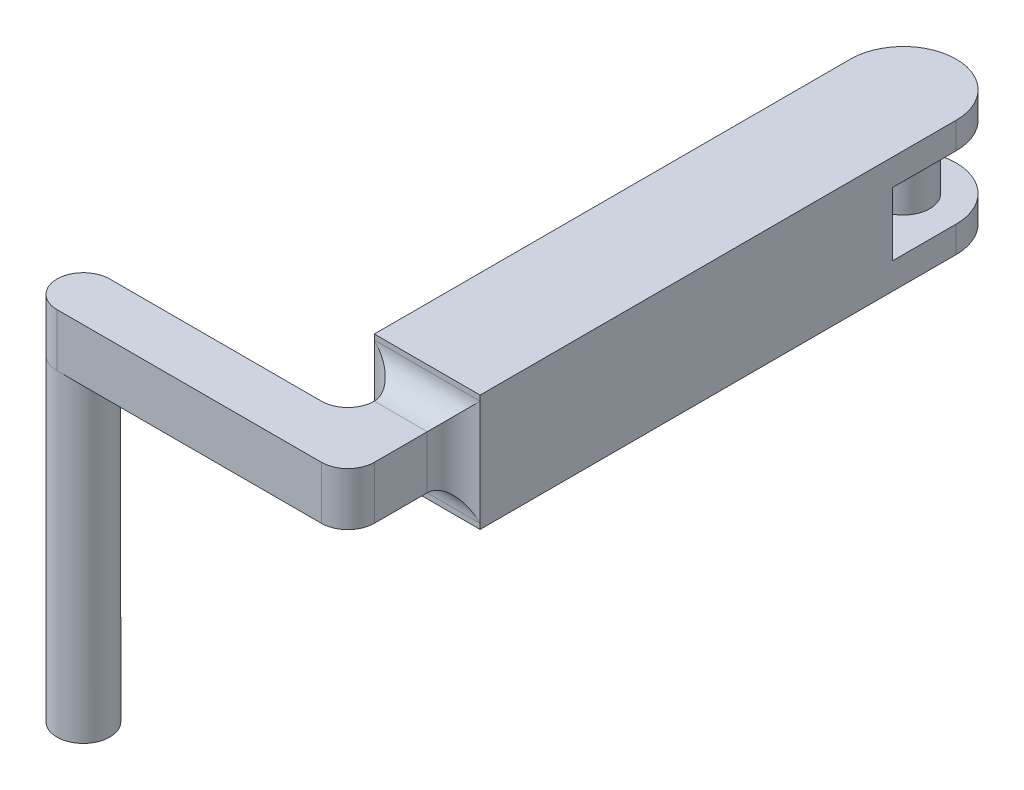
ISO-10303-21;
HEADER;
FILE_DESCRIPTION(('STEP AP214'),'2;1');
FILE_NAME('part.step','',(''),(''),'','','');
FILE_SCHEMA(('AUTOMOTIVE_DESIGN { 1 0 10303 214 1 1 1 1 }'));
ENDSEC;
DATA;
#1=APPLICATION_CONTEXT('core data for automotive mechanical design processes');
#2=APPLICATION_PROTOCOL_DEFINITION('international standard','automotive_design',2000,#1);
#3=PRODUCT_CONTEXT('',#1,'mechanical');
#4=PRODUCT('Part','Part','',(#3));
#5=PRODUCT_RELATED_PRODUCT_CATEGORY('part','',(#4));
#6=PRODUCT_DEFINITION_FORMATION('','',#4);
#7=PRODUCT_DEFINITION_CONTEXT('part definition',#1,'design');
#8=PRODUCT_DEFINITION('design','',#6,#7);
#9=PRODUCT_DEFINITION_SHAPE('','',#8);
#10=(LENGTH_UNIT() NAMED_UNIT(*) SI_UNIT(.MILLI.,.METRE.));
#11=(NAMED_UNIT(*) PLANE_ANGLE_UNIT() SI_UNIT($,.RADIAN.));
#12=(NAMED_UNIT(*) SI_UNIT($,.STERADIAN.) SOLID_ANGLE_UNIT());
#13=UNCERTAINTY_MEASURE_WITH_UNIT(LENGTH_MEASURE(1.E-05),#10,'distance_accuracy_value','');
#14=(GEOMETRIC_REPRESENTATION_CONTEXT(3) GLOBAL_UNCERTAINTY_ASSIGNED_CONTEXT((#13)) GLOBAL_UNIT_ASSIGNED_CONTEXT((#10,
#11,#12)) REPRESENTATION_CONTEXT('',''));
#15=CARTESIAN_POINT('',(0.,0.,0.));
#16=DIRECTION('',(0.,0.,1.));
#17=DIRECTION('',(1.,0.,0.));
#18=AXIS2_PLACEMENT_3D('',#15,#16,#17);
#19=CARTESIAN_POINT('',(-3.176,-0.635,-59.055));
#20=DIRECTION('',(0.,-1.,0.));
#21=DIRECTION('',(0.,0.,-1.));
#22=AXIS2_PLACEMENT_3D('',#19,#20,#21);
#23=PLANE('',#22);
#24=DIRECTION('',(0.,0.,1.));
#25=VECTOR('',#24,1.);
#26=CARTESIAN_POINT('',(25.4,-0.635,-59.055));
#27=LINE('',#26,#25);
#28=CARTESIAN_POINT('',(25.4,-0.635,-66.675));
#29=VERTEX_POINT('',#28);
#30=CARTESIAN_POINT('',(25.4,-0.635,-59.055));
#31=VERTEX_POINT('',#30);
#32=EDGE_CURVE('E347',#29,#31,#27,.T.);
#33=ORIENTED_EDGE('',*,*,#32,.T.);
#34=DIRECTION('',(1.,0.,0.));
#35=VECTOR('',#34,1.);
#36=CARTESIAN_POINT('',(-3.176,-0.635,-59.055));
#37=LINE('',#36,#35);
#38=CARTESIAN_POINT('',(38.1,-0.635,-59.055));
#39=VERTEX_POINT('',#38);
#40=EDGE_CURVE('E177',#31,#39,#37,.T.);
#41=ORIENTED_EDGE('',*,*,#40,.T.);
#42=DIRECTION('',(0.,0.,-1.));
#43=VECTOR('',#42,1.);
#44=CARTESIAN_POINT('',(38.1,-0.635,-59.055));
#45=LINE('',#44,#43);
#46=CARTESIAN_POINT('',(38.1,-0.635,-66.675));
#47=VERTEX_POINT('',#46);
#48=EDGE_CURVE('E171',#39,#47,#45,.T.);
#49=ORIENTED_EDGE('',*,*,#48,.T.);
#50=CARTESIAN_POINT('',(31.75,-0.635,-66.675));
#51=DIRECTION('',(0.,-1.,0.));
#52=DIRECTION('',(0.,0.,-1.));
#53=AXIS2_PLACEMENT_3D('',#50,#51,#52);
#54=CIRCLE('',#53,6.35);
#55=CARTESIAN_POINT('',(31.75,-0.635,-73.025));
#56=VERTEX_POINT('',#55);
#57=EDGE_CURVE('E175',#56,#47,#54,.T.);
#58=ORIENTED_EDGE('',*,*,#57,.F.);
#59=CARTESIAN_POINT('',(31.75,-0.635,-66.675));
#60=DIRECTION('',(0.,-1.,0.));
#61=DIRECTION('',(0.,0.,-1.));
#62=AXIS2_PLACEMENT_3D('',#59,#60,#61);
#63=CIRCLE('',#62,6.35);
#64=EDGE_CURVE('E192',#29,#56,#63,.T.);
#65=ORIENTED_EDGE('',*,*,#64,.F.);
#66=EDGE_LOOP('',(#33,#41,#49,#58,#65));
#67=FACE_BOUND('',#66,.T.);
#68=CARTESIAN_POINT('',(31.75,-0.635,-66.675));
#69=DIRECTION('',(0.,-1.,0.));
#70=DIRECTION('',(0.,0.,-1.));
#71=AXIS2_PLACEMENT_3D('',#68,#69,#70);
#72=CIRCLE('',#71,3.175);
#73=CARTESIAN_POINT('',(31.75,-0.635,-69.85));
#74=VERTEX_POINT('',#73);
#75=EDGE_CURVE('E11',#74,#74,#72,.F.);
#76=ORIENTED_EDGE('',*,*,#75,.F.);
#77=EDGE_LOOP('',(#76));
#78=FACE_BOUND('',#77,.T.);
#79=ADVANCED_FACE('F34',(#67,#78),#23,.F.);
#80=CARTESIAN_POINT('',(-3.176,6.985,-59.055));
#81=DIRECTION('',(0.,1.,0.));
#82=DIRECTION('',(0.,0.,1.));
#83=AXIS2_PLACEMENT_3D('',#80,#81,#82);
#84=PLANE('',#83);
#85=DIRECTION('',(0.,0.,-1.));
#86=VECTOR('',#85,1.);
#87=CARTESIAN_POINT('',(25.4,6.985,-59.055));
#88=LINE('',#87,#86);
#89=CARTESIAN_POINT('',(25.4,6.985,-59.055));
#90=VERTEX_POINT('',#89);
#91=CARTESIAN_POINT('',(25.4,6.985,-66.675));
#92=VERTEX_POINT('',#91);
#93=EDGE_CURVE('E49',#90,#92,#88,.T.);
#94=ORIENTED_EDGE('',*,*,#93,.T.);
#95=CARTESIAN_POINT('',(31.75,6.985,-66.675));
#96=DIRECTION('',(0.,1.,0.));
#97=DIRECTION('',(0.,0.,1.));
#98=AXIS2_PLACEMENT_3D('',#95,#96,#97);
#99=CIRCLE('',#98,6.35);
#100=CARTESIAN_POINT('',(31.75,6.985,-73.025));
#101=VERTEX_POINT('',#100);
#102=EDGE_CURVE('E216',#101,#92,#99,.T.);
#103=ORIENTED_EDGE('',*,*,#102,.F.);
#104=CARTESIAN_POINT('',(31.75,6.985,-66.675));
#105=DIRECTION('',(0.,1.,0.));
#106=DIRECTION('',(0.,0.,1.));
#107=AXIS2_PLACEMENT_3D('',#104,#105,#106);
#108=CIRCLE('',#107,6.35);
#109=CARTESIAN_POINT('',(38.1,6.985,-66.675));
#110=VERTEX_POINT('',#109);
#111=EDGE_CURVE('E193',#110,#101,#108,.T.);
#112=ORIENTED_EDGE('',*,*,#111,.F.);
#113=DIRECTION('',(0.,0.,1.));
#114=VECTOR('',#113,1.);
#115=CARTESIAN_POINT('',(38.1,6.985,-59.055));
#116=LINE('',#115,#114);
#117=CARTESIAN_POINT('',(38.1,6.985,-59.055));
#118=VERTEX_POINT('',#117);
#119=EDGE_CURVE('E349',#110,#118,#116,.T.);
#120=ORIENTED_EDGE('',*,*,#119,.T.);
#121=DIRECTION('',(1.,0.,0.));
#122=VECTOR('',#121,1.);
#123=CARTESIAN_POINT('',(-3.176,6.985,-59.055));
#124=LINE('',#123,#122);
#125=EDGE_CURVE('E182',#90,#118,#124,.T.);
#126=ORIENTED_EDGE('',*,*,#125,.F.);
#127=EDGE_LOOP('',(#94,#103,#112,#120,#126));
#128=FACE_BOUND('',#127,.T.);
#129=CARTESIAN_POINT('',(31.75,6.985,-66.675));
#130=DIRECTION('',(0.,1.,0.));
#131=DIRECTION('',(0.,0.,1.));
#132=AXIS2_PLACEMENT_3D('',#129,#130,#131);
#133=CIRCLE('',#132,3.175);
#134=CARTESIAN_POINT('',(31.75,6.985,-63.5));
#135=VERTEX_POINT('',#134);
#136=EDGE_CURVE('E42',#135,#135,#133,.F.);
#137=ORIENTED_EDGE('',*,*,#136,.F.);
#138=EDGE_LOOP('',(#137));
#139=FACE_BOUND('',#138,.T.);
#140=ADVANCED_FACE('F335',(#128,#139),#84,.F.);
#141=CARTESIAN_POINT('',(31.75,10.16,-66.675));
#142=DIRECTION('',(0.,-1.,0.));
#143=DIRECTION('',(0.,0.,-1.));
#144=AXIS2_PLACEMENT_3D('',#141,#142,#143);
#145=CYLINDRICAL_SURFACE('',#144,6.35);
#146=ORIENTED_EDGE('',*,*,#57,.T.);
#147=DIRECTION('',(0.,-1.,0.));
#148=VECTOR('',#147,1.);
#149=CARTESIAN_POINT('',(38.1,10.16,-66.675));
#150=LINE('',#149,#148);
#151=CARTESIAN_POINT('',(38.1,-3.81,-66.675));
#152=VERTEX_POINT('',#151);
#153=EDGE_CURVE('E190',#152,#47,#150,.F.);
#154=ORIENTED_EDGE('',*,*,#153,.F.);
#155=CARTESIAN_POINT('',(31.75,-3.81,-66.675));
#156=DIRECTION('',(0.,-1.,0.));
#157=DIRECTION('',(0.,0.,-1.));
#158=AXIS2_PLACEMENT_3D('',#155,#156,#157);
#159=CIRCLE('',#158,6.35);
#160=CARTESIAN_POINT('',(31.75,-3.81,-73.025));
#161=VERTEX_POINT('',#160);
#162=EDGE_CURVE('E321',#161,#152,#159,.T.);
#163=ORIENTED_EDGE('',*,*,#162,.F.);
#164=DIRECTION('',(0.,-1.,0.));
#165=VECTOR('',#164,1.);
#166=CARTESIAN_POINT('',(31.75,10.16,-73.025));
#167=LINE('',#166,#165);
#168=EDGE_CURVE('E191',#56,#161,#167,.T.);
#169=ORIENTED_EDGE('',*,*,#168,.F.);
#170=EDGE_LOOP('',(#146,#154,#163,#169));
#171=FACE_BOUND('',#170,.T.);
#172=ADVANCED_FACE('F188',(#171),#145,.T.);
#173=CARTESIAN_POINT('',(31.75,10.16,-66.675));
#174=DIRECTION('',(0.,-1.,0.));
#175=DIRECTION('',(0.,0.,-1.));
#176=AXIS2_PLACEMENT_3D('',#173,#174,#175);
#177=CYLINDRICAL_SURFACE('',#176,6.35);
#178=ORIENTED_EDGE('',*,*,#64,.T.);
#179=ORIENTED_EDGE('',*,*,#168,.T.);
#180=CARTESIAN_POINT('',(31.75,-3.81,-66.675));
#181=DIRECTION('',(0.,-1.,0.));
#182=DIRECTION('',(0.,0.,-1.));
#183=AXIS2_PLACEMENT_3D('',#180,#181,#182);
#184=CIRCLE('',#183,6.35);
#185=CARTESIAN_POINT('',(25.4,-3.81,-66.675));
#186=VERTEX_POINT('',#185);
#187=EDGE_CURVE('E323',#186,#161,#184,.T.);
#188=ORIENTED_EDGE('',*,*,#187,.F.);
#189=DIRECTION('',(0.,-1.,0.));
#190=VECTOR('',#189,1.);
#191=CARTESIAN_POINT('',(25.4,10.16,-66.675));
#192=LINE('',#191,#190);
#193=EDGE_CURVE('E310',#29,#186,#192,.T.);
#194=ORIENTED_EDGE('',*,*,#193,.F.);
#195=EDGE_LOOP('',(#178,#179,#188,#194));
#196=FACE_BOUND('',#195,.T.);
#197=ADVANCED_FACE('F481',(#196),#177,.T.);
#198=CARTESIAN_POINT('',(25.4,10.16,-9.525));
#199=DIRECTION('',(0.,0.,-1.));
#200=DIRECTION('',(-1.,0.,0.));
#201=AXIS2_PLACEMENT_3D('',#198,#199,#200);
#202=PLANE('',#201);
#203=DIRECTION('',(0.,-1.,0.));
#204=VECTOR('',#203,1.);
#205=CARTESIAN_POINT('',(38.1,10.16,-9.525));
#206=LINE('',#205,#204);
#207=CARTESIAN_POINT('',(38.1,-3.175,-9.525));
#208=VERTEX_POINT('',#207);
#209=CARTESIAN_POINT('',(38.1,-3.81,-9.525));
#210=VERTEX_POINT('',#209);
#211=EDGE_CURVE('E234',#208,#210,#206,.T.);
#212=ORIENTED_EDGE('',*,*,#211,.F.);
#213=DIRECTION('',(1.,0.,0.));
#214=VECTOR('',#213,1.);
#215=CARTESIAN_POINT('',(25.4,-3.175,-9.525));
#216=LINE('',#215,#214);
#217=CARTESIAN_POINT('',(25.4,-3.175,-9.525));
#218=VERTEX_POINT('',#217);
#219=EDGE_CURVE('E303',#208,#218,#216,.F.);
#220=ORIENTED_EDGE('',*,*,#219,.T.);
#221=DIRECTION('',(0.,-1.,0.));
#222=VECTOR('',#221,1.);
#223=CARTESIAN_POINT('',(25.4,10.16,-9.525));
#224=LINE('',#223,#222);
#225=CARTESIAN_POINT('',(25.4,-3.81,-9.525));
#226=VERTEX_POINT('',#225);
#227=EDGE_CURVE('E238',#218,#226,#224,.T.);
#228=ORIENTED_EDGE('',*,*,#227,.T.);
#229=DIRECTION('',(1.,0.,0.));
#230=VECTOR('',#229,1.);
#231=CARTESIAN_POINT('',(25.4,-3.81,-9.525));
#232=LINE('',#231,#230);
#233=EDGE_CURVE('E223',#226,#210,#232,.T.);
#234=ORIENTED_EDGE('',*,*,#233,.T.);
#235=EDGE_LOOP('',(#212,#220,#228,#234));
#236=FACE_BOUND('',#235,.T.);
#237=ADVANCED_FACE('F425',(#236),#202,.F.);
#238=CARTESIAN_POINT('',(0.,0.,0.));
#239=DIRECTION('',(0.,-1.,0.));
#240=DIRECTION('',(0.,0.,-1.));
#241=AXIS2_PLACEMENT_3D('',#238,#239,#240);
#242=PLANE('',#241);
#243=CARTESIAN_POINT('',(25.4,0.,-6.35));
#244=DIRECTION('',(0.,-1.,0.));
#245=DIRECTION('',(0.,0.,-1.));
#246=AXIS2_PLACEMENT_3D('',#243,#244,#245);
#247=CIRCLE('',#246,3.175);
#248=CARTESIAN_POINT('',(25.4,0.,-3.175));
#249=VERTEX_POINT('',#248);
#250=CARTESIAN_POINT('',(28.575,0.,-6.35));
#251=VERTEX_POINT('',#250);
#252=EDGE_CURVE('E294',#249,#251,#247,.F.);
#253=ORIENTED_EDGE('',*,*,#252,.T.);
#254=DIRECTION('',(1.,0.,0.));
#255=VECTOR('',#254,1.);
#256=CARTESIAN_POINT('',(0.,0.,-6.35));
#257=LINE('',#256,#255);
#258=CARTESIAN_POINT('',(34.925,0.,-6.35));
#259=VERTEX_POINT('',#258);
#260=EDGE_CURVE('E305',#251,#259,#257,.T.);
#261=ORIENTED_EDGE('',*,*,#260,.T.);
#262=DIRECTION('',(0.,0.,-1.));
#263=VECTOR('',#262,1.);
#264=CARTESIAN_POINT('',(34.925,0.,-60.325));
#265=LINE('',#264,#263);
#266=CARTESIAN_POINT('',(34.925,0.,0.));
#267=VERTEX_POINT('',#266);
#268=EDGE_CURVE('E259',#267,#259,#265,.T.);
#269=ORIENTED_EDGE('',*,*,#268,.F.);
#270=CARTESIAN_POINT('',(31.75,0.,0.));
#271=DIRECTION('',(0.,-1.,0.));
#272=DIRECTION('',(0.,0.,-1.));
#273=AXIS2_PLACEMENT_3D('',#270,#271,#272);
#274=CIRCLE('',#273,3.175);
#275=CARTESIAN_POINT('',(31.75,0.,3.175));
#276=VERTEX_POINT('',#275);
#277=EDGE_CURVE('E282',#267,#276,#274,.T.);
#278=ORIENTED_EDGE('',*,*,#277,.T.);
#279=DIRECTION('',(1.,0.,0.));
#280=VECTOR('',#279,1.);
#281=CARTESIAN_POINT('',(34.925,0.,3.17499999999999));
#282=LINE('',#281,#280);
#283=CARTESIAN_POINT('',(0.,0.,3.175));
#284=VERTEX_POINT('',#283);
#285=EDGE_CURVE('E256',#284,#276,#282,.T.);
#286=ORIENTED_EDGE('',*,*,#285,.F.);
#287=CARTESIAN_POINT('',(0.,0.,0.));
#288=DIRECTION('',(0.,1.,0.));
#289=DIRECTION('',(0.,0.,1.));
#290=AXIS2_PLACEMENT_3D('',#287,#288,#289);
#291=CIRCLE('',#290,3.175);
#292=CARTESIAN_POINT('',(0.,0.,-3.175));
#293=VERTEX_POINT('',#292);
#294=EDGE_CURVE('E267',#284,#293,#291,.T.);
#295=ORIENTED_EDGE('',*,*,#294,.T.);
#296=DIRECTION('',(-1.,0.,0.));
#297=VECTOR('',#296,1.);
#298=CARTESIAN_POINT('',(-3.175,0.,-3.175));
#299=LINE('',#298,#297);
#300=EDGE_CURVE('E249',#249,#293,#299,.T.);
#301=ORIENTED_EDGE('',*,*,#300,.F.);
#302=EDGE_LOOP('',(#253,#261,#269,#278,#286,#295,#301));
#303=FACE_BOUND('',#302,.T.);
#304=ADVANCED_FACE('F390',(#303),#242,.T.);
#305=CARTESIAN_POINT('',(34.925,6.35,-60.325));
#306=DIRECTION('',(-1.,0.,0.));
#307=DIRECTION('',(0.,0.,1.));
#308=AXIS2_PLACEMENT_3D('',#305,#306,#307);
#309=PLANE('',#308);
#310=ORIENTED_EDGE('',*,*,#268,.T.);
#311=DIRECTION('',(0.,-1.,0.));
#312=VECTOR('',#311,1.);
#313=CARTESIAN_POINT('',(34.925,6.35,-6.35));
#314=LINE('',#313,#312);
#315=CARTESIAN_POINT('',(34.925,6.35,-6.35));
#316=VERTEX_POINT('',#315);
#317=EDGE_CURVE('E307',#259,#316,#314,.F.);
#318=ORIENTED_EDGE('',*,*,#317,.T.);
#319=DIRECTION('',(0.,0.,-1.));
#320=VECTOR('',#319,1.);
#321=CARTESIAN_POINT('',(34.925,6.35,-60.325));
#322=LINE('',#321,#320);
#323=CARTESIAN_POINT('',(34.925,6.35,0.));
#324=VERTEX_POINT('',#323);
#325=EDGE_CURVE('E248',#324,#316,#322,.T.);
#326=ORIENTED_EDGE('',*,*,#325,.F.);
#327=DIRECTION('',(0.,-1.,0.));
#328=VECTOR('',#327,1.);
#329=CARTESIAN_POINT('',(34.925,6.35,0.));
#330=LINE('',#329,#328);
#331=EDGE_CURVE('E279',#324,#267,#330,.T.);
#332=ORIENTED_EDGE('',*,*,#331,.T.);
#333=EDGE_LOOP('',(#310,#318,#326,#332));
#334=FACE_BOUND('',#333,.T.);
#335=ADVANCED_FACE('F417',(#334),#309,.F.);
#336=CARTESIAN_POINT('',(0.,6.35,0.));
#337=DIRECTION('',(0.,-1.,0.));
#338=DIRECTION('',(0.,0.,-1.));
#339=AXIS2_PLACEMENT_3D('',#336,#337,#338);
#340=PLANE('',#339);
#341=ORIENTED_EDGE('',*,*,#325,.T.);
#342=DIRECTION('',(1.,0.,0.));
#343=VECTOR('',#342,1.);
#344=CARTESIAN_POINT('',(28.575,6.35,-6.35));
#345=LINE('',#344,#343);
#346=CARTESIAN_POINT('',(28.575,6.35,-6.35));
#347=VERTEX_POINT('',#346);
#348=EDGE_CURVE('E309',#316,#347,#345,.F.);
#349=ORIENTED_EDGE('',*,*,#348,.T.);
#350=CARTESIAN_POINT('',(25.4,6.35,-6.35));
#351=DIRECTION('',(0.,-1.,0.));
#352=DIRECTION('',(0.,0.,-1.));
#353=AXIS2_PLACEMENT_3D('',#350,#351,#352);
#354=CIRCLE('',#353,3.175);
#355=CARTESIAN_POINT('',(25.4,6.35,-3.175));
#356=VERTEX_POINT('',#355);
#357=EDGE_CURVE('E297',#347,#356,#354,.T.);
#358=ORIENTED_EDGE('',*,*,#357,.T.);
#359=DIRECTION('',(-1.,0.,0.));
#360=VECTOR('',#359,1.);
#361=CARTESIAN_POINT('',(-3.175,6.35,-3.175));
#362=LINE('',#361,#360);
#363=CARTESIAN_POINT('',(0.,6.35,-3.175));
#364=VERTEX_POINT('',#363);
#365=EDGE_CURVE('E252',#356,#364,#362,.T.);
#366=ORIENTED_EDGE('',*,*,#365,.T.);
#367=CARTESIAN_POINT('',(0.,6.35,0.));
#368=DIRECTION('',(0.,-1.,0.));
#369=DIRECTION('',(0.,0.,-1.));
#370=AXIS2_PLACEMENT_3D('',#367,#368,#369);
#371=CIRCLE('',#370,3.175);
#372=CARTESIAN_POINT('',(-3.175,6.35,0.));
#373=VERTEX_POINT('',#372);
#374=EDGE_CURVE('E290',#364,#373,#371,.F.);
#375=ORIENTED_EDGE('',*,*,#374,.T.);
#376=CARTESIAN_POINT('',(0.,6.35,0.));
#377=DIRECTION('',(0.,-1.,0.));
#378=DIRECTION('',(0.,0.,-1.));
#379=AXIS2_PLACEMENT_3D('',#376,#377,#378);
#380=CIRCLE('',#379,3.175);
#381=CARTESIAN_POINT('',(0.,6.35,3.175));
#382=VERTEX_POINT('',#381);
#383=EDGE_CURVE('E288',#373,#382,#380,.F.);
#384=ORIENTED_EDGE('',*,*,#383,.T.);
#385=DIRECTION('',(1.,0.,0.));
#386=VECTOR('',#385,1.);
#387=CARTESIAN_POINT('',(34.925,6.35,3.17499999999999));
#388=LINE('',#387,#386);
#389=CARTESIAN_POINT('',(31.75,6.35,3.175));
#390=VERTEX_POINT('',#389);
#391=EDGE_CURVE('E245',#382,#390,#388,.T.);
#392=ORIENTED_EDGE('',*,*,#391,.T.);
#393=CARTESIAN_POINT('',(31.75,6.35,0.));
#394=DIRECTION('',(0.,-1.,0.));
#395=DIRECTION('',(0.,0.,-1.));
#396=AXIS2_PLACEMENT_3D('',#393,#394,#395);
#397=CIRCLE('',#396,3.175);
#398=EDGE_CURVE('E292',#390,#324,#397,.F.);
#399=ORIENTED_EDGE('',*,*,#398,.T.);
#400=EDGE_LOOP('',(#341,#349,#358,#366,#375,#384,#392,#399));
#401=FACE_BOUND('',#400,.T.);
#402=ADVANCED_FACE('F373',(#401),#340,.F.);
#403=CARTESIAN_POINT('',(0.,-38.1,0.));
#404=DIRECTION('',(0.,1.,0.));
#405=DIRECTION('',(0.,0.,1.));
#406=AXIS2_PLACEMENT_3D('',#403,#404,#405);
#407=CYLINDRICAL_SURFACE('',#406,3.175);
#408=CARTESIAN_POINT('',(0.,-38.1,0.));
#409=DIRECTION('',(0.,1.,0.));
#410=DIRECTION('',(0.,0.,1.));
#411=AXIS2_PLACEMENT_3D('',#408,#409,#410);
#412=CIRCLE('',#411,3.175);
#413=CARTESIAN_POINT('',(0.,-38.1,3.175));
#414=VERTEX_POINT('',#413);
#415=EDGE_CURVE('E263',#414,#414,#412,.T.);
#416=ORIENTED_EDGE('',*,*,#415,.T.);
#417=EDGE_LOOP('',(#416));
#418=FACE_BOUND('',#417,.T.);
#419=ORIENTED_EDGE('',*,*,#294,.F.);
#420=CARTESIAN_POINT('',(-3.175,0.,0.));
#421=VERTEX_POINT('',#420);
#422=EDGE_CURVE('E255',#421,#284,#291,.T.);
#423=ORIENTED_EDGE('',*,*,#422,.F.);
#424=EDGE_CURVE('E270',#293,#421,#291,.T.);
#425=ORIENTED_EDGE('',*,*,#424,.F.);
#426=EDGE_LOOP('',(#419,#423,#425));
#427=FACE_BOUND('',#426,.T.);
#428=ADVANCED_FACE('F407',(#418,#427),#407,.T.);
#429=CARTESIAN_POINT('',(0.,-38.1,0.));
#430=DIRECTION('',(0.,1.,0.));
#431=DIRECTION('',(0.,0.,1.));
#432=AXIS2_PLACEMENT_3D('',#429,#430,#431);
#433=PLANE('',#432);
#434=ORIENTED_EDGE('',*,*,#415,.F.);
#435=EDGE_LOOP('',(#434));
#436=FACE_BOUND('',#435,.T.);
#437=ADVANCED_FACE('F457',(#436),#433,.F.);
#438=CARTESIAN_POINT('',(34.925,6.35,3.17499999999999));
#439=DIRECTION('',(0.,0.,-1.));
#440=DIRECTION('',(-1.,0.,0.));
#441=AXIS2_PLACEMENT_3D('',#438,#439,#440);
#442=PLANE('',#441);
#443=ORIENTED_EDGE('',*,*,#285,.T.);
#444=DIRECTION('',(0.,-1.,0.));
#445=VECTOR('',#444,1.);
#446=CARTESIAN_POINT('',(31.75,6.35,3.175));
#447=LINE('',#446,#445);
#448=EDGE_CURVE('E286',#276,#390,#447,.F.);
#449=ORIENTED_EDGE('',*,*,#448,.T.);
#450=ORIENTED_EDGE('',*,*,#391,.F.);
#451=DIRECTION('',(0.,-1.,0.));
#452=VECTOR('',#451,1.);
#453=CARTESIAN_POINT('',(0.,6.35,3.175));
#454=LINE('',#453,#452);
#455=EDGE_CURVE('E284',#382,#284,#454,.T.);
#456=ORIENTED_EDGE('',*,*,#455,.T.);
#457=EDGE_LOOP('',(#443,#449,#450,#456));
#458=FACE_BOUND('',#457,.T.);
#459=ADVANCED_FACE('F411',(#458),#442,.F.);
#460=CARTESIAN_POINT('',(-3.175,6.35,-3.175));
#461=DIRECTION('',(0.,0.,1.));
#462=DIRECTION('',(1.,0.,0.));
#463=AXIS2_PLACEMENT_3D('',#460,#461,#462);
#464=PLANE('',#463);
#465=ORIENTED_EDGE('',*,*,#365,.F.);
#466=DIRECTION('',(0.,-1.,0.));
#467=VECTOR('',#466,1.);
#468=CARTESIAN_POINT('',(25.4,0.,-3.175));
#469=LINE('',#468,#467);
#470=EDGE_CURVE('E273',#356,#249,#469,.T.);
#471=ORIENTED_EDGE('',*,*,#470,.T.);
#472=ORIENTED_EDGE('',*,*,#300,.T.);
#473=DIRECTION('',(0.,-1.,0.));
#474=VECTOR('',#473,1.);
#475=CARTESIAN_POINT('',(0.,6.35,-3.175));
#476=LINE('',#475,#474);
#477=EDGE_CURVE('E266',#293,#364,#476,.F.);
#478=ORIENTED_EDGE('',*,*,#477,.T.);
#479=EDGE_LOOP('',(#465,#471,#472,#478));
#480=FACE_BOUND('',#479,.T.);
#481=ADVANCED_FACE('F392',(#480),#464,.F.);
#482=CARTESIAN_POINT('',(25.4,6.35,-6.35));
#483=DIRECTION('',(0.,1.,0.));
#484=DIRECTION('',(0.,0.,1.));
#485=AXIS2_PLACEMENT_3D('',#482,#483,#484);
#486=CYLINDRICAL_SURFACE('',#485,3.175);
#487=ORIENTED_EDGE('',*,*,#357,.F.);
#488=DIRECTION('',(0.,-1.,0.));
#489=VECTOR('',#488,1.);
#490=CARTESIAN_POINT('',(28.575,6.35,-6.35));
#491=LINE('',#490,#489);
#492=EDGE_CURVE('E276',#251,#347,#491,.F.);
#493=ORIENTED_EDGE('',*,*,#492,.F.);
#494=ORIENTED_EDGE('',*,*,#252,.F.);
#495=ORIENTED_EDGE('',*,*,#470,.F.);
#496=EDGE_LOOP('',(#487,#493,#494,#495));
#497=FACE_BOUND('',#496,.T.);
#498=ADVANCED_FACE('F379',(#497),#486,.F.);
#499=CARTESIAN_POINT('',(31.75,6.35,0.));
#500=DIRECTION('',(0.,-1.,0.));
#501=DIRECTION('',(0.,0.,-1.));
#502=AXIS2_PLACEMENT_3D('',#499,#500,#501);
#503=CYLINDRICAL_SURFACE('',#502,3.175);
#504=ORIENTED_EDGE('',*,*,#398,.F.);
#505=ORIENTED_EDGE('',*,*,#448,.F.);
#506=ORIENTED_EDGE('',*,*,#277,.F.);
#507=ORIENTED_EDGE('',*,*,#331,.F.);
#508=EDGE_LOOP('',(#504,#505,#506,#507));
#509=FACE_BOUND('',#508,.T.);
#510=ADVANCED_FACE('F414',(#509),#503,.T.);
#511=CARTESIAN_POINT('',(0.,6.35,0.));
#512=DIRECTION('',(0.,-1.,0.));
#513=DIRECTION('',(0.,0.,-1.));
#514=AXIS2_PLACEMENT_3D('',#511,#512,#513);
#515=CYLINDRICAL_SURFACE('',#514,3.175);
#516=ORIENTED_EDGE('',*,*,#455,.F.);
#517=ORIENTED_EDGE('',*,*,#383,.F.);
#518=DIRECTION('',(0.,-1.,0.));
#519=VECTOR('',#518,1.);
#520=CARTESIAN_POINT('',(-3.175,6.35,0.));
#521=LINE('',#520,#519);
#522=EDGE_CURVE('E243',#421,#373,#521,.F.);
#523=ORIENTED_EDGE('',*,*,#522,.F.);
#524=ORIENTED_EDGE('',*,*,#422,.T.);
#525=EDGE_LOOP('',(#516,#517,#523,#524));
#526=FACE_BOUND('',#525,.T.);
#527=ADVANCED_FACE('F401',(#526),#515,.T.);
#528=CARTESIAN_POINT('',(0.,6.35,0.));
#529=DIRECTION('',(0.,-1.,0.));
#530=DIRECTION('',(0.,0.,-1.));
#531=AXIS2_PLACEMENT_3D('',#528,#529,#530);
#532=CYLINDRICAL_SURFACE('',#531,3.175);
#533=ORIENTED_EDGE('',*,*,#374,.F.);
#534=ORIENTED_EDGE('',*,*,#477,.F.);
#535=ORIENTED_EDGE('',*,*,#424,.T.);
#536=ORIENTED_EDGE('',*,*,#522,.T.);
#537=EDGE_LOOP('',(#533,#534,#535,#536));
#538=FACE_BOUND('',#537,.T.);
#539=ADVANCED_FACE('F404',(#538),#532,.T.);
#540=CARTESIAN_POINT('',(25.4,10.16,-9.525));
#541=DIRECTION('',(1.,0.,0.));
#542=DIRECTION('',(0.,0.,-1.));
#543=AXIS2_PLACEMENT_3D('',#540,#541,#542);
#544=PLANE('',#543);
#545=DIRECTION('',(0.,1.,0.));
#546=VECTOR('',#545,1.);
#547=CARTESIAN_POINT('',(25.4,-0.635,-59.055));
#548=LINE('',#547,#546);
#549=EDGE_CURVE('E344',#31,#90,#548,.T.);
#550=ORIENTED_EDGE('',*,*,#549,.F.);
#551=ORIENTED_EDGE('',*,*,#32,.F.);
#552=ORIENTED_EDGE('',*,*,#193,.T.);
#553=DIRECTION('',(0.,0.,1.));
#554=VECTOR('',#553,1.);
#555=CARTESIAN_POINT('',(25.4,-3.81,-9.525));
#556=LINE('',#555,#554);
#557=EDGE_CURVE('E221',#186,#226,#556,.T.);
#558=ORIENTED_EDGE('',*,*,#557,.T.);
#559=ORIENTED_EDGE('',*,*,#227,.F.);
#560=CARTESIAN_POINT('',(25.4,9.525,-9.525));
#561=VERTEX_POINT('',#560);
#562=EDGE_CURVE('E244',#561,#218,#224,.T.);
#563=ORIENTED_EDGE('',*,*,#562,.F.);
#564=CARTESIAN_POINT('',(25.4,10.16,-9.525));
#565=VERTEX_POINT('',#564);
#566=EDGE_CURVE('E240',#565,#561,#224,.T.);
#567=ORIENTED_EDGE('',*,*,#566,.F.);
#568=DIRECTION('',(0.,0.,1.));
#569=VECTOR('',#568,1.);
#570=CARTESIAN_POINT('',(25.4,10.16,-9.525));
#571=LINE('',#570,#569);
#572=CARTESIAN_POINT('',(25.4,10.16,-66.675));
#573=VERTEX_POINT('',#572);
#574=EDGE_CURVE('E228',#573,#565,#571,.T.);
#575=ORIENTED_EDGE('',*,*,#574,.F.);
#576=EDGE_CURVE('E318',#573,#92,#192,.T.);
#577=ORIENTED_EDGE('',*,*,#576,.T.);
#578=ORIENTED_EDGE('',*,*,#93,.F.);
#579=EDGE_LOOP('',(#550,#551,#552,#558,#559,#563,#567,#575,#577,#578));
#580=FACE_BOUND('',#579,.T.);
#581=ADVANCED_FACE('F331',(#580),#544,.F.);
#582=ORIENTED_EDGE('',*,*,#566,.T.);
#583=DIRECTION('',(1.,0.,0.));
#584=VECTOR('',#583,1.);
#585=CARTESIAN_POINT('',(34.925,9.525,-9.525));
#586=LINE('',#585,#584);
#587=CARTESIAN_POINT('',(38.1,9.525,-9.525));
#588=VERTEX_POINT('',#587);
#589=EDGE_CURVE('E299',#561,#588,#586,.T.);
#590=ORIENTED_EDGE('',*,*,#589,.T.);
#591=CARTESIAN_POINT('',(38.1,10.16,-9.525));
#592=VERTEX_POINT('',#591);
#593=EDGE_CURVE('E235',#592,#588,#206,.T.);
#594=ORIENTED_EDGE('',*,*,#593,.F.);
#595=DIRECTION('',(1.,0.,0.));
#596=VECTOR('',#595,1.);
#597=CARTESIAN_POINT('',(25.4,10.16,-9.525));
#598=LINE('',#597,#596);
#599=EDGE_CURVE('E230',#565,#592,#598,.T.);
#600=ORIENTED_EDGE('',*,*,#599,.F.);
#601=EDGE_LOOP('',(#582,#590,#594,#600));
#602=FACE_BOUND('',#601,.T.);
#603=ADVANCED_FACE('F357',(#602),#202,.F.);
#604=CARTESIAN_POINT('',(38.1,10.16,-9.525));
#605=DIRECTION('',(-1.,0.,0.));
#606=DIRECTION('',(0.,0.,1.));
#607=AXIS2_PLACEMENT_3D('',#604,#605,#606);
#608=PLANE('',#607);
#609=ORIENTED_EDGE('',*,*,#153,.T.);
#610=ORIENTED_EDGE('',*,*,#48,.F.);
#611=DIRECTION('',(0.,-1.,0.));
#612=VECTOR('',#611,1.);
#613=CARTESIAN_POINT('',(38.1,-0.635,-59.055));
#614=LINE('',#613,#612);
#615=EDGE_CURVE('E183',#118,#39,#614,.T.);
#616=ORIENTED_EDGE('',*,*,#615,.F.);
#617=ORIENTED_EDGE('',*,*,#119,.F.);
#618=CARTESIAN_POINT('',(38.1,10.16,-66.675));
#619=VERTEX_POINT('',#618);
#620=EDGE_CURVE('E199',#110,#619,#150,.F.);
#621=ORIENTED_EDGE('',*,*,#620,.T.);
#622=DIRECTION('',(0.,0.,-1.));
#623=VECTOR('',#622,1.);
#624=CARTESIAN_POINT('',(38.1,10.16,-9.525));
#625=LINE('',#624,#623);
#626=EDGE_CURVE('E232',#592,#619,#625,.T.);
#627=ORIENTED_EDGE('',*,*,#626,.F.);
#628=ORIENTED_EDGE('',*,*,#593,.T.);
#629=EDGE_CURVE('E239',#588,#208,#206,.T.);
#630=ORIENTED_EDGE('',*,*,#629,.T.);
#631=ORIENTED_EDGE('',*,*,#211,.T.);
#632=DIRECTION('',(0.,0.,-1.));
#633=VECTOR('',#632,1.);
#634=CARTESIAN_POINT('',(38.1,-3.81,-9.525));
#635=LINE('',#634,#633);
#636=EDGE_CURVE('E198',#210,#152,#635,.T.);
#637=ORIENTED_EDGE('',*,*,#636,.T.);
#638=EDGE_LOOP('',(#609,#610,#616,#617,#621,#627,#628,#630,#631,#637));
#639=FACE_BOUND('',#638,.T.);
#640=ADVANCED_FACE('F196',(#639),#608,.F.);
#641=CARTESIAN_POINT('',(0.,10.16,0.));
#642=DIRECTION('',(0.,-1.,0.));
#643=DIRECTION('',(0.,0.,-1.));
#644=AXIS2_PLACEMENT_3D('',#641,#642,#643);
#645=PLANE('',#644);
#646=CARTESIAN_POINT('',(31.75,10.16,-66.675));
#647=DIRECTION('',(0.,-1.,0.));
#648=DIRECTION('',(0.,0.,-1.));
#649=AXIS2_PLACEMENT_3D('',#646,#647,#648);
#650=CIRCLE('',#649,6.35);
#651=CARTESIAN_POINT('',(31.75,10.16,-73.025));
#652=VERTEX_POINT('',#651);
#653=EDGE_CURVE('E57',#619,#652,#650,.F.);
#654=ORIENTED_EDGE('',*,*,#653,.T.);
#655=CARTESIAN_POINT('',(31.75,10.16,-66.675));
#656=DIRECTION('',(0.,-1.,0.));
#657=DIRECTION('',(0.,0.,-1.));
#658=AXIS2_PLACEMENT_3D('',#655,#656,#657);
#659=CIRCLE('',#658,6.35);
#660=EDGE_CURVE('E202',#652,#573,#659,.F.);
#661=ORIENTED_EDGE('',*,*,#660,.T.);
#662=ORIENTED_EDGE('',*,*,#574,.T.);
#663=ORIENTED_EDGE('',*,*,#599,.T.);
#664=ORIENTED_EDGE('',*,*,#626,.T.);
#665=EDGE_LOOP('',(#654,#661,#662,#663,#664));
#666=FACE_BOUND('',#665,.T.);
#667=ADVANCED_FACE('F325',(#666),#645,.F.);
#668=CARTESIAN_POINT('',(0.,-3.81,0.));
#669=DIRECTION('',(0.,-1.,0.));
#670=DIRECTION('',(0.,0.,-1.));
#671=AXIS2_PLACEMENT_3D('',#668,#669,#670);
#672=PLANE('',#671);
#673=ORIENTED_EDGE('',*,*,#557,.F.);
#674=ORIENTED_EDGE('',*,*,#187,.T.);
#675=ORIENTED_EDGE('',*,*,#162,.T.);
#676=ORIENTED_EDGE('',*,*,#636,.F.);
#677=ORIENTED_EDGE('',*,*,#233,.F.);
#678=EDGE_LOOP('',(#673,#674,#675,#676,#677));
#679=FACE_BOUND('',#678,.T.);
#680=ADVANCED_FACE('F440',(#679),#672,.T.);
#681=CARTESIAN_POINT('',(38.1,10.16,-6.35));
#682=DIRECTION('',(0.,1.,0.));
#683=DIRECTION('',(0.,0.,1.));
#684=AXIS2_PLACEMENT_3D('',#681,#682,#683);
#685=CYLINDRICAL_SURFACE('',#684,3.175);
#686=CARTESIAN_POINT('',(38.1,9.525,-6.35));
#687=DIRECTION('',(-0.707106781186547,0.707106781186547,0.));
#688=DIRECTION('',(-0.707106781186547,-0.707106781186547,0.));
#689=AXIS2_PLACEMENT_3D('',#686,#687,#688);
#690=ELLIPSE('',#689,4.49012806053458,3.175);
#691=EDGE_CURVE('E313',#316,#588,#690,.F.);
#692=ORIENTED_EDGE('',*,*,#691,.F.);
#693=ORIENTED_EDGE('',*,*,#317,.F.);
#694=CARTESIAN_POINT('',(38.1,-3.175,-6.35));
#695=DIRECTION('',(0.707106781186547,0.707106781186547,0.));
#696=DIRECTION('',(-0.707106781186547,0.707106781186547,0.));
#697=AXIS2_PLACEMENT_3D('',#694,#695,#696);
#698=ELLIPSE('',#697,4.49012806053458,3.175);
#699=EDGE_CURVE('E224',#208,#259,#698,.T.);
#700=ORIENTED_EDGE('',*,*,#699,.F.);
#701=ORIENTED_EDGE('',*,*,#629,.F.);
#702=EDGE_LOOP('',(#692,#693,#700,#701));
#703=FACE_BOUND('',#702,.T.);
#704=ADVANCED_FACE('F364',(#703),#685,.F.);
#705=CARTESIAN_POINT('',(0.,-3.175,-6.35));
#706=DIRECTION('',(1.,0.,0.));
#707=DIRECTION('',(0.,0.,-1.));
#708=AXIS2_PLACEMENT_3D('',#705,#706,#707);
#709=CYLINDRICAL_SURFACE('',#708,3.175);
#710=ORIENTED_EDGE('',*,*,#699,.T.);
#711=ORIENTED_EDGE('',*,*,#260,.F.);
#712=CARTESIAN_POINT('',(25.4,-3.175,-6.35));
#713=DIRECTION('',(0.707106781186547,-0.707106781186547,0.));
#714=DIRECTION('',(0.707106781186547,0.707106781186547,0.));
#715=AXIS2_PLACEMENT_3D('',#712,#713,#714);
#716=ELLIPSE('',#715,4.49012806053458,3.175);
#717=EDGE_CURVE('E211',#218,#251,#716,.T.);
#718=ORIENTED_EDGE('',*,*,#717,.F.);
#719=ORIENTED_EDGE('',*,*,#219,.F.);
#720=EDGE_LOOP('',(#710,#711,#718,#719));
#721=FACE_BOUND('',#720,.T.);
#722=ADVANCED_FACE('F386',(#721),#709,.F.);
#723=CARTESIAN_POINT('',(25.4,9.525,-6.35));
#724=DIRECTION('',(-1.,0.,0.));
#725=DIRECTION('',(0.,0.,1.));
#726=AXIS2_PLACEMENT_3D('',#723,#724,#725);
#727=CYLINDRICAL_SURFACE('',#726,3.175);
#728=ORIENTED_EDGE('',*,*,#691,.T.);
#729=ORIENTED_EDGE('',*,*,#589,.F.);
#730=CARTESIAN_POINT('',(25.4,9.525,-6.35));
#731=DIRECTION('',(-0.707106781186547,-0.707106781186547,0.));
#732=DIRECTION('',(-0.707106781186547,0.707106781186547,0.));
#733=AXIS2_PLACEMENT_3D('',#730,#731,#732);
#734=ELLIPSE('',#733,4.49012806053458,3.175);
#735=EDGE_CURVE('E208',#347,#561,#734,.F.);
#736=ORIENTED_EDGE('',*,*,#735,.F.);
#737=ORIENTED_EDGE('',*,*,#348,.F.);
#738=EDGE_LOOP('',(#728,#729,#736,#737));
#739=FACE_BOUND('',#738,.T.);
#740=ADVANCED_FACE('F369',(#739),#727,.F.);
#741=CARTESIAN_POINT('',(25.4,10.16,-6.35));
#742=DIRECTION('',(0.,-1.,0.));
#743=DIRECTION('',(0.,0.,-1.));
#744=AXIS2_PLACEMENT_3D('',#741,#742,#743);
#745=CYLINDRICAL_SURFACE('',#744,3.175);
#746=ORIENTED_EDGE('',*,*,#717,.T.);
#747=ORIENTED_EDGE('',*,*,#492,.T.);
#748=ORIENTED_EDGE('',*,*,#735,.T.);
#749=ORIENTED_EDGE('',*,*,#562,.T.);
#750=EDGE_LOOP('',(#746,#747,#748,#749));
#751=FACE_BOUND('',#750,.T.);
#752=ADVANCED_FACE('F381',(#751),#745,.F.);
#753=ORIENTED_EDGE('',*,*,#111,.T.);
#754=EDGE_CURVE('E206',#652,#101,#167,.T.);
#755=ORIENTED_EDGE('',*,*,#754,.F.);
#756=ORIENTED_EDGE('',*,*,#653,.F.);
#757=ORIENTED_EDGE('',*,*,#620,.F.);
#758=EDGE_LOOP('',(#753,#755,#756,#757));
#759=FACE_BOUND('',#758,.T.);
#760=ADVANCED_FACE('F36',(#759),#145,.T.);
#761=ORIENTED_EDGE('',*,*,#102,.T.);
#762=ORIENTED_EDGE('',*,*,#576,.F.);
#763=ORIENTED_EDGE('',*,*,#660,.F.);
#764=ORIENTED_EDGE('',*,*,#754,.T.);
#765=EDGE_LOOP('',(#761,#762,#763,#764));
#766=FACE_BOUND('',#765,.T.);
#767=ADVANCED_FACE('F333',(#766),#177,.T.);
#768=CARTESIAN_POINT('',(-3.176,-0.635,-59.055));
#769=DIRECTION('',(0.,0.,1.));
#770=DIRECTION('',(1.,0.,0.));
#771=AXIS2_PLACEMENT_3D('',#768,#769,#770);
#772=PLANE('',#771);
#773=ORIENTED_EDGE('',*,*,#549,.T.);
#774=ORIENTED_EDGE('',*,*,#125,.T.);
#775=ORIENTED_EDGE('',*,*,#615,.T.);
#776=ORIENTED_EDGE('',*,*,#40,.F.);
#777=EDGE_LOOP('',(#773,#774,#775,#776));
#778=FACE_BOUND('',#777,.T.);
#779=ADVANCED_FACE('F353',(#778),#772,.F.);
#780=CARTESIAN_POINT('',(31.75,9.525,-66.675));
#781=DIRECTION('',(0.,-1.,0.));
#782=DIRECTION('',(0.,0.,-1.));
#783=AXIS2_PLACEMENT_3D('',#780,#781,#782);
#784=CYLINDRICAL_SURFACE('',#783,3.175);
#785=ORIENTED_EDGE('',*,*,#75,.T.);
#786=EDGE_LOOP('',(#785));
#787=FACE_BOUND('',#786,.T.);
#788=ORIENTED_EDGE('',*,*,#136,.T.);
#789=EDGE_LOOP('',(#788));
#790=FACE_BOUND('',#789,.T.);
#791=ADVANCED_FACE('F437',(#787,#790),#784,.T.);
#792=CLOSED_SHELL('',(#79,#140,#172,#197,#237,#304,#335,#402,#428,#437,#459,#481,#498,#510,#527,
#539,#581,#603,#640,#667,#680,#704,#722,#740,#752,#760,#767,#779,#791));
#793=MANIFOLD_SOLID_BREP('B2',#792);
#794=ADVANCED_BREP_SHAPE_REPRESENTATION('',(#18,#793),#14);
#795=SHAPE_DEFINITION_REPRESENTATION(#9,#794);
ENDSEC;
END-ISO-10303-21;
